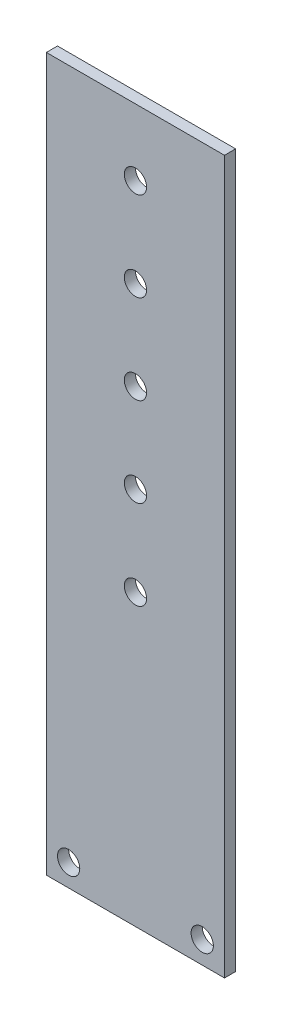
ISO-10303-21;
HEADER;
FILE_DESCRIPTION(('STEP AP214'),'2;1');
FILE_NAME('part.step','',(''),(''),'','','');
FILE_SCHEMA(('AUTOMOTIVE_DESIGN { 1 0 10303 214 1 1 1 1 }'));
ENDSEC;
DATA;
#1=APPLICATION_CONTEXT('core data for automotive mechanical design processes');
#2=APPLICATION_PROTOCOL_DEFINITION('international standard','automotive_design',2000,#1);
#3=PRODUCT_CONTEXT('',#1,'mechanical');
#4=PRODUCT('Part','Part','',(#3));
#5=PRODUCT_RELATED_PRODUCT_CATEGORY('part','',(#4));
#6=PRODUCT_DEFINITION_FORMATION('','',#4);
#7=PRODUCT_DEFINITION_CONTEXT('part definition',#1,'design');
#8=PRODUCT_DEFINITION('design','',#6,#7);
#9=PRODUCT_DEFINITION_SHAPE('','',#8);
#10=(LENGTH_UNIT() NAMED_UNIT(*) SI_UNIT(.MILLI.,.METRE.));
#11=(NAMED_UNIT(*) PLANE_ANGLE_UNIT() SI_UNIT($,.RADIAN.));
#12=(NAMED_UNIT(*) SI_UNIT($,.STERADIAN.) SOLID_ANGLE_UNIT());
#13=UNCERTAINTY_MEASURE_WITH_UNIT(LENGTH_MEASURE(1.E-05),#10,'distance_accuracy_value','');
#14=(GEOMETRIC_REPRESENTATION_CONTEXT(3) GLOBAL_UNCERTAINTY_ASSIGNED_CONTEXT((#13)) GLOBAL_UNIT_ASSIGNED_CONTEXT((#10,
#11,#12)) REPRESENTATION_CONTEXT('',''));
#15=CARTESIAN_POINT('',(0.,0.,0.));
#16=DIRECTION('',(0.,0.,1.));
#17=DIRECTION('',(1.,0.,0.));
#18=AXIS2_PLACEMENT_3D('',#15,#16,#17);
#19=CARTESIAN_POINT('',(0.,0.,3.175));
#20=DIRECTION('',(0.,0.,-1.));
#21=DIRECTION('',(-1.,0.,0.));
#22=AXIS2_PLACEMENT_3D('',#19,#20,#21);
#23=PLANE('',#22);
#24=DIRECTION('',(0.,-1.,0.));
#25=VECTOR('',#24,1.);
#26=CARTESIAN_POINT('',(0.,0.,3.175));
#27=LINE('',#26,#25);
#28=CARTESIAN_POINT('',(0.,203.2,3.175));
#29=VERTEX_POINT('',#28);
#30=CARTESIAN_POINT('',(0.,0.,3.175));
#31=VERTEX_POINT('',#30);
#32=EDGE_CURVE('E85',#29,#31,#27,.T.);
#33=ORIENTED_EDGE('',*,*,#32,.T.);
#34=DIRECTION('',(1.,0.,0.));
#35=VECTOR('',#34,1.);
#36=CARTESIAN_POINT('',(0.,0.,3.175));
#37=LINE('',#36,#35);
#38=CARTESIAN_POINT('',(50.8,0.,3.175));
#39=VERTEX_POINT('',#38);
#40=EDGE_CURVE('E80',#31,#39,#37,.T.);
#41=ORIENTED_EDGE('',*,*,#40,.T.);
#42=DIRECTION('',(0.,1.,0.));
#43=VECTOR('',#42,1.);
#44=CARTESIAN_POINT('',(50.8,0.,3.175));
#45=LINE('',#44,#43);
#46=CARTESIAN_POINT('',(50.8,203.2,3.175));
#47=VERTEX_POINT('',#46);
#48=EDGE_CURVE('E83',#39,#47,#45,.T.);
#49=ORIENTED_EDGE('',*,*,#48,.T.);
#50=DIRECTION('',(-1.,0.,0.));
#51=VECTOR('',#50,1.);
#52=CARTESIAN_POINT('',(0.,203.2,3.175));
#53=LINE('',#52,#51);
#54=EDGE_CURVE('E50',#47,#29,#53,.T.);
#55=ORIENTED_EDGE('',*,*,#54,.T.);
#56=EDGE_LOOP('',(#33,#41,#49,#55));
#57=FACE_BOUND('',#56,.T.);
#58=CARTESIAN_POINT('',(6.35,6.35,3.175));
#59=DIRECTION('',(0.,0.,1.));
#60=DIRECTION('',(1.,0.,0.));
#61=AXIS2_PLACEMENT_3D('',#58,#59,#60);
#62=CIRCLE('',#61,3.175);
#63=CARTESIAN_POINT('',(9.525,6.35,3.175));
#64=VERTEX_POINT('',#63);
#65=EDGE_CURVE('E100',#64,#64,#62,.T.);
#66=ORIENTED_EDGE('',*,*,#65,.F.);
#67=EDGE_LOOP('',(#66));
#68=FACE_BOUND('',#67,.T.);
#69=CARTESIAN_POINT('',(44.45,6.35,3.175));
#70=DIRECTION('',(0.,0.,1.));
#71=DIRECTION('',(1.,0.,0.));
#72=AXIS2_PLACEMENT_3D('',#69,#70,#71);
#73=CIRCLE('',#72,3.175);
#74=CARTESIAN_POINT('',(47.625,6.35,3.175));
#75=VERTEX_POINT('',#74);
#76=EDGE_CURVE('E115',#75,#75,#73,.T.);
#77=ORIENTED_EDGE('',*,*,#76,.F.);
#78=EDGE_LOOP('',(#77));
#79=FACE_BOUND('',#78,.T.);
#80=CARTESIAN_POINT('',(25.4,184.2,3.175));
#81=DIRECTION('',(0.,0.,1.));
#82=DIRECTION('',(1.,0.,0.));
#83=AXIS2_PLACEMENT_3D('',#80,#81,#82);
#84=CIRCLE('',#83,3.175);
#85=CARTESIAN_POINT('',(28.575,184.2,3.175));
#86=VERTEX_POINT('',#85);
#87=EDGE_CURVE('E121',#86,#86,#84,.T.);
#88=ORIENTED_EDGE('',*,*,#87,.F.);
#89=EDGE_LOOP('',(#88));
#90=FACE_BOUND('',#89,.T.);
#91=CARTESIAN_POINT('',(25.4,158.8,3.175));
#92=DIRECTION('',(0.,0.,1.));
#93=DIRECTION('',(1.,0.,0.));
#94=AXIS2_PLACEMENT_3D('',#91,#92,#93);
#95=CIRCLE('',#94,3.175);
#96=CARTESIAN_POINT('',(28.575,158.8,3.175));
#97=VERTEX_POINT('',#96);
#98=EDGE_CURVE('E127',#97,#97,#95,.T.);
#99=ORIENTED_EDGE('',*,*,#98,.F.);
#100=EDGE_LOOP('',(#99));
#101=FACE_BOUND('',#100,.T.);
#102=CARTESIAN_POINT('',(25.4,133.4,3.175));
#103=DIRECTION('',(0.,0.,1.));
#104=DIRECTION('',(1.,0.,0.));
#105=AXIS2_PLACEMENT_3D('',#102,#103,#104);
#106=CIRCLE('',#105,3.175);
#107=CARTESIAN_POINT('',(28.575,133.4,3.175));
#108=VERTEX_POINT('',#107);
#109=EDGE_CURVE('E133',#108,#108,#106,.T.);
#110=ORIENTED_EDGE('',*,*,#109,.F.);
#111=EDGE_LOOP('',(#110));
#112=FACE_BOUND('',#111,.T.);
#113=CARTESIAN_POINT('',(25.4,108.,3.175));
#114=DIRECTION('',(0.,0.,1.));
#115=DIRECTION('',(1.,0.,0.));
#116=AXIS2_PLACEMENT_3D('',#113,#114,#115);
#117=CIRCLE('',#116,3.175);
#118=CARTESIAN_POINT('',(28.575,108.,3.175));
#119=VERTEX_POINT('',#118);
#120=EDGE_CURVE('E139',#119,#119,#117,.T.);
#121=ORIENTED_EDGE('',*,*,#120,.F.);
#122=EDGE_LOOP('',(#121));
#123=FACE_BOUND('',#122,.T.);
#124=CARTESIAN_POINT('',(25.4,82.6,3.175));
#125=DIRECTION('',(0.,0.,1.));
#126=DIRECTION('',(1.,0.,0.));
#127=AXIS2_PLACEMENT_3D('',#124,#125,#126);
#128=CIRCLE('',#127,3.175);
#129=CARTESIAN_POINT('',(28.575,82.6,3.175));
#130=VERTEX_POINT('',#129);
#131=EDGE_CURVE('E145',#130,#130,#128,.T.);
#132=ORIENTED_EDGE('',*,*,#131,.F.);
#133=EDGE_LOOP('',(#132));
#134=FACE_BOUND('',#133,.T.);
#135=ADVANCED_FACE('F33',(#57,#68,#79,#90,#101,#112,#123,#134),#23,.F.);
#136=CARTESIAN_POINT('',(0.,0.,0.));
#137=DIRECTION('',(0.,0.,-1.));
#138=DIRECTION('',(-1.,0.,0.));
#139=AXIS2_PLACEMENT_3D('',#136,#137,#138);
#140=PLANE('',#139);
#141=CARTESIAN_POINT('',(25.4,108.,0.));
#142=DIRECTION('',(0.,0.,1.));
#143=DIRECTION('',(1.,0.,0.));
#144=AXIS2_PLACEMENT_3D('',#141,#142,#143);
#145=CIRCLE('',#144,3.175);
#146=CARTESIAN_POINT('',(28.575,108.,0.));
#147=VERTEX_POINT('',#146);
#148=EDGE_CURVE('E142',#147,#147,#145,.T.);
#149=ORIENTED_EDGE('',*,*,#148,.T.);
#150=EDGE_LOOP('',(#149));
#151=FACE_BOUND('',#150,.T.);
#152=CARTESIAN_POINT('',(25.4,158.8,0.));
#153=DIRECTION('',(0.,0.,1.));
#154=DIRECTION('',(1.,0.,0.));
#155=AXIS2_PLACEMENT_3D('',#152,#153,#154);
#156=CIRCLE('',#155,3.175);
#157=CARTESIAN_POINT('',(28.575,158.8,0.));
#158=VERTEX_POINT('',#157);
#159=EDGE_CURVE('E130',#158,#158,#156,.T.);
#160=ORIENTED_EDGE('',*,*,#159,.T.);
#161=EDGE_LOOP('',(#160));
#162=FACE_BOUND('',#161,.T.);
#163=CARTESIAN_POINT('',(44.45,6.35,0.));
#164=DIRECTION('',(0.,0.,1.));
#165=DIRECTION('',(1.,0.,0.));
#166=AXIS2_PLACEMENT_3D('',#163,#164,#165);
#167=CIRCLE('',#166,3.175);
#168=CARTESIAN_POINT('',(47.625,6.35,0.));
#169=VERTEX_POINT('',#168);
#170=EDGE_CURVE('E118',#169,#169,#167,.T.);
#171=ORIENTED_EDGE('',*,*,#170,.T.);
#172=EDGE_LOOP('',(#171));
#173=FACE_BOUND('',#172,.T.);
#174=DIRECTION('',(0.,-1.,0.));
#175=VECTOR('',#174,1.);
#176=CARTESIAN_POINT('',(0.,0.,0.));
#177=LINE('',#176,#175);
#178=CARTESIAN_POINT('',(0.,203.2,0.));
#179=VERTEX_POINT('',#178);
#180=CARTESIAN_POINT('',(0.,0.,0.));
#181=VERTEX_POINT('',#180);
#182=EDGE_CURVE('E97',#179,#181,#177,.T.);
#183=ORIENTED_EDGE('',*,*,#182,.F.);
#184=DIRECTION('',(-1.,0.,0.));
#185=VECTOR('',#184,1.);
#186=CARTESIAN_POINT('',(0.,203.2,0.));
#187=LINE('',#186,#185);
#188=CARTESIAN_POINT('',(50.8,203.2,0.));
#189=VERTEX_POINT('',#188);
#190=EDGE_CURVE('E73',#189,#179,#187,.T.);
#191=ORIENTED_EDGE('',*,*,#190,.F.);
#192=DIRECTION('',(0.,1.,0.));
#193=VECTOR('',#192,1.);
#194=CARTESIAN_POINT('',(50.8,0.,0.));
#195=LINE('',#194,#193);
#196=CARTESIAN_POINT('',(50.8,0.,0.));
#197=VERTEX_POINT('',#196);
#198=EDGE_CURVE('E67',#197,#189,#195,.T.);
#199=ORIENTED_EDGE('',*,*,#198,.F.);
#200=DIRECTION('',(1.,0.,0.));
#201=VECTOR('',#200,1.);
#202=CARTESIAN_POINT('',(0.,0.,0.));
#203=LINE('',#202,#201);
#204=EDGE_CURVE('E89',#181,#197,#203,.T.);
#205=ORIENTED_EDGE('',*,*,#204,.F.);
#206=EDGE_LOOP('',(#183,#191,#199,#205));
#207=FACE_BOUND('',#206,.T.);
#208=CARTESIAN_POINT('',(6.35,6.35,0.));
#209=DIRECTION('',(0.,0.,1.));
#210=DIRECTION('',(1.,0.,0.));
#211=AXIS2_PLACEMENT_3D('',#208,#209,#210);
#212=CIRCLE('',#211,3.175);
#213=CARTESIAN_POINT('',(9.525,6.35,0.));
#214=VERTEX_POINT('',#213);
#215=EDGE_CURVE('E112',#214,#214,#212,.T.);
#216=ORIENTED_EDGE('',*,*,#215,.T.);
#217=EDGE_LOOP('',(#216));
#218=FACE_BOUND('',#217,.T.);
#219=CARTESIAN_POINT('',(25.4,184.2,0.));
#220=DIRECTION('',(0.,0.,1.));
#221=DIRECTION('',(1.,0.,0.));
#222=AXIS2_PLACEMENT_3D('',#219,#220,#221);
#223=CIRCLE('',#222,3.175);
#224=CARTESIAN_POINT('',(28.575,184.2,0.));
#225=VERTEX_POINT('',#224);
#226=EDGE_CURVE('E124',#225,#225,#223,.T.);
#227=ORIENTED_EDGE('',*,*,#226,.T.);
#228=EDGE_LOOP('',(#227));
#229=FACE_BOUND('',#228,.T.);
#230=CARTESIAN_POINT('',(25.4,133.4,0.));
#231=DIRECTION('',(0.,0.,1.));
#232=DIRECTION('',(1.,0.,0.));
#233=AXIS2_PLACEMENT_3D('',#230,#231,#232);
#234=CIRCLE('',#233,3.175);
#235=CARTESIAN_POINT('',(28.575,133.4,0.));
#236=VERTEX_POINT('',#235);
#237=EDGE_CURVE('E136',#236,#236,#234,.T.);
#238=ORIENTED_EDGE('',*,*,#237,.T.);
#239=EDGE_LOOP('',(#238));
#240=FACE_BOUND('',#239,.T.);
#241=CARTESIAN_POINT('',(25.4,82.6,0.));
#242=DIRECTION('',(0.,0.,1.));
#243=DIRECTION('',(1.,0.,0.));
#244=AXIS2_PLACEMENT_3D('',#241,#242,#243);
#245=CIRCLE('',#244,3.175);
#246=CARTESIAN_POINT('',(28.575,82.6,0.));
#247=VERTEX_POINT('',#246);
#248=EDGE_CURVE('E148',#247,#247,#245,.T.);
#249=ORIENTED_EDGE('',*,*,#248,.T.);
#250=EDGE_LOOP('',(#249));
#251=FACE_BOUND('',#250,.T.);
#252=ADVANCED_FACE('F108',(#151,#162,#173,#207,#218,#229,#240,#251),#140,.T.);
#253=CARTESIAN_POINT('',(0.,0.,3.175));
#254=DIRECTION('',(1.,0.,0.));
#255=DIRECTION('',(0.,0.,-1.));
#256=AXIS2_PLACEMENT_3D('',#253,#254,#255);
#257=PLANE('',#256);
#258=ORIENTED_EDGE('',*,*,#182,.T.);
#259=DIRECTION('',(0.,0.,-1.));
#260=VECTOR('',#259,1.);
#261=CARTESIAN_POINT('',(0.,0.,3.175));
#262=LINE('',#261,#260);
#263=EDGE_CURVE('E11',#31,#181,#262,.T.);
#264=ORIENTED_EDGE('',*,*,#263,.F.);
#265=ORIENTED_EDGE('',*,*,#32,.F.);
#266=DIRECTION('',(0.,0.,-1.));
#267=VECTOR('',#266,1.);
#268=CARTESIAN_POINT('',(0.,203.2,3.175));
#269=LINE('',#268,#267);
#270=EDGE_CURVE('E93',#29,#179,#269,.T.);
#271=ORIENTED_EDGE('',*,*,#270,.T.);
#272=EDGE_LOOP('',(#258,#264,#265,#271));
#273=FACE_BOUND('',#272,.T.);
#274=ADVANCED_FACE('F35',(#273),#257,.F.);
#275=CARTESIAN_POINT('',(0.,0.,3.175));
#276=DIRECTION('',(0.,1.,0.));
#277=DIRECTION('',(0.,0.,1.));
#278=AXIS2_PLACEMENT_3D('',#275,#276,#277);
#279=PLANE('',#278);
#280=ORIENTED_EDGE('',*,*,#204,.T.);
#281=DIRECTION('',(0.,0.,-1.));
#282=VECTOR('',#281,1.);
#283=CARTESIAN_POINT('',(50.8,0.,3.175));
#284=LINE('',#283,#282);
#285=EDGE_CURVE('E42',#39,#197,#284,.T.);
#286=ORIENTED_EDGE('',*,*,#285,.F.);
#287=ORIENTED_EDGE('',*,*,#40,.F.);
#288=ORIENTED_EDGE('',*,*,#263,.T.);
#289=EDGE_LOOP('',(#280,#286,#287,#288));
#290=FACE_BOUND('',#289,.T.);
#291=ADVANCED_FACE('F88',(#290),#279,.F.);
#292=CARTESIAN_POINT('',(50.8,0.,3.175));
#293=DIRECTION('',(-1.,0.,0.));
#294=DIRECTION('',(0.,0.,1.));
#295=AXIS2_PLACEMENT_3D('',#292,#293,#294);
#296=PLANE('',#295);
#297=ORIENTED_EDGE('',*,*,#198,.T.);
#298=DIRECTION('',(0.,0.,-1.));
#299=VECTOR('',#298,1.);
#300=CARTESIAN_POINT('',(50.8,203.2,3.175));
#301=LINE('',#300,#299);
#302=EDGE_CURVE('E90',#47,#189,#301,.T.);
#303=ORIENTED_EDGE('',*,*,#302,.F.);
#304=ORIENTED_EDGE('',*,*,#48,.F.);
#305=ORIENTED_EDGE('',*,*,#285,.T.);
#306=EDGE_LOOP('',(#297,#303,#304,#305));
#307=FACE_BOUND('',#306,.T.);
#308=ADVANCED_FACE('F91',(#307),#296,.F.);
#309=CARTESIAN_POINT('',(0.,203.2,3.175));
#310=DIRECTION('',(0.,-1.,0.));
#311=DIRECTION('',(0.,0.,-1.));
#312=AXIS2_PLACEMENT_3D('',#309,#310,#311);
#313=PLANE('',#312);
#314=ORIENTED_EDGE('',*,*,#190,.T.);
#315=ORIENTED_EDGE('',*,*,#270,.F.);
#316=ORIENTED_EDGE('',*,*,#54,.F.);
#317=ORIENTED_EDGE('',*,*,#302,.T.);
#318=EDGE_LOOP('',(#314,#315,#316,#317));
#319=FACE_BOUND('',#318,.T.);
#320=ADVANCED_FACE('F105',(#319),#313,.F.);
#321=CARTESIAN_POINT('',(6.35,6.35,3.175));
#322=DIRECTION('',(0.,0.,-1.));
#323=DIRECTION('',(-1.,0.,0.));
#324=AXIS2_PLACEMENT_3D('',#321,#322,#323);
#325=CYLINDRICAL_SURFACE('',#324,3.175);
#326=ORIENTED_EDGE('',*,*,#65,.T.);
#327=EDGE_LOOP('',(#326));
#328=FACE_BOUND('',#327,.T.);
#329=ORIENTED_EDGE('',*,*,#215,.F.);
#330=EDGE_LOOP('',(#329));
#331=FACE_BOUND('',#330,.T.);
#332=ADVANCED_FACE('F165',(#328,#331),#325,.F.);
#333=CARTESIAN_POINT('',(44.45,6.35,3.175));
#334=DIRECTION('',(0.,0.,-1.));
#335=DIRECTION('',(-1.,0.,0.));
#336=AXIS2_PLACEMENT_3D('',#333,#334,#335);
#337=CYLINDRICAL_SURFACE('',#336,3.175);
#338=ORIENTED_EDGE('',*,*,#76,.T.);
#339=EDGE_LOOP('',(#338));
#340=FACE_BOUND('',#339,.T.);
#341=ORIENTED_EDGE('',*,*,#170,.F.);
#342=EDGE_LOOP('',(#341));
#343=FACE_BOUND('',#342,.T.);
#344=ADVANCED_FACE('F211',(#340,#343),#337,.F.);
#345=CARTESIAN_POINT('',(25.4,184.2,3.175));
#346=DIRECTION('',(0.,0.,-1.));
#347=DIRECTION('',(-1.,0.,0.));
#348=AXIS2_PLACEMENT_3D('',#345,#346,#347);
#349=CYLINDRICAL_SURFACE('',#348,3.175);
#350=ORIENTED_EDGE('',*,*,#87,.T.);
#351=EDGE_LOOP('',(#350));
#352=FACE_BOUND('',#351,.T.);
#353=ORIENTED_EDGE('',*,*,#226,.F.);
#354=EDGE_LOOP('',(#353));
#355=FACE_BOUND('',#354,.T.);
#356=ADVANCED_FACE('F219',(#352,#355),#349,.F.);
#357=CARTESIAN_POINT('',(25.4,158.8,3.175));
#358=DIRECTION('',(0.,0.,-1.));
#359=DIRECTION('',(-1.,0.,0.));
#360=AXIS2_PLACEMENT_3D('',#357,#358,#359);
#361=CYLINDRICAL_SURFACE('',#360,3.175);
#362=ORIENTED_EDGE('',*,*,#98,.T.);
#363=EDGE_LOOP('',(#362));
#364=FACE_BOUND('',#363,.T.);
#365=ORIENTED_EDGE('',*,*,#159,.F.);
#366=EDGE_LOOP('',(#365));
#367=FACE_BOUND('',#366,.T.);
#368=ADVANCED_FACE('F227',(#364,#367),#361,.F.);
#369=CARTESIAN_POINT('',(25.4,133.4,3.175));
#370=DIRECTION('',(0.,0.,-1.));
#371=DIRECTION('',(-1.,0.,0.));
#372=AXIS2_PLACEMENT_3D('',#369,#370,#371);
#373=CYLINDRICAL_SURFACE('',#372,3.175);
#374=ORIENTED_EDGE('',*,*,#109,.T.);
#375=EDGE_LOOP('',(#374));
#376=FACE_BOUND('',#375,.T.);
#377=ORIENTED_EDGE('',*,*,#237,.F.);
#378=EDGE_LOOP('',(#377));
#379=FACE_BOUND('',#378,.T.);
#380=ADVANCED_FACE('F236',(#376,#379),#373,.F.);
#381=CARTESIAN_POINT('',(25.4,108.,3.175));
#382=DIRECTION('',(0.,0.,-1.));
#383=DIRECTION('',(-1.,0.,0.));
#384=AXIS2_PLACEMENT_3D('',#381,#382,#383);
#385=CYLINDRICAL_SURFACE('',#384,3.175);
#386=ORIENTED_EDGE('',*,*,#120,.T.);
#387=EDGE_LOOP('',(#386));
#388=FACE_BOUND('',#387,.T.);
#389=ORIENTED_EDGE('',*,*,#148,.F.);
#390=EDGE_LOOP('',(#389));
#391=FACE_BOUND('',#390,.T.);
#392=ADVANCED_FACE('F245',(#388,#391),#385,.F.);
#393=CARTESIAN_POINT('',(25.4,82.6,3.175));
#394=DIRECTION('',(0.,0.,-1.));
#395=DIRECTION('',(-1.,0.,0.));
#396=AXIS2_PLACEMENT_3D('',#393,#394,#395);
#397=CYLINDRICAL_SURFACE('',#396,3.175);
#398=ORIENTED_EDGE('',*,*,#131,.T.);
#399=EDGE_LOOP('',(#398));
#400=FACE_BOUND('',#399,.T.);
#401=ORIENTED_EDGE('',*,*,#248,.F.);
#402=EDGE_LOOP('',(#401));
#403=FACE_BOUND('',#402,.T.);
#404=ADVANCED_FACE('F154',(#400,#403),#397,.F.);
#405=CLOSED_SHELL('',(#135,#252,#274,#291,#308,#320,#332,#344,#356,#368,#380,#392,#404));
#406=MANIFOLD_SOLID_BREP('B2',#405);
#407=ADVANCED_BREP_SHAPE_REPRESENTATION('',(#18,#406),#14);
#408=SHAPE_DEFINITION_REPRESENTATION(#9,#407);
ENDSEC;
END-ISO-10303-21;
